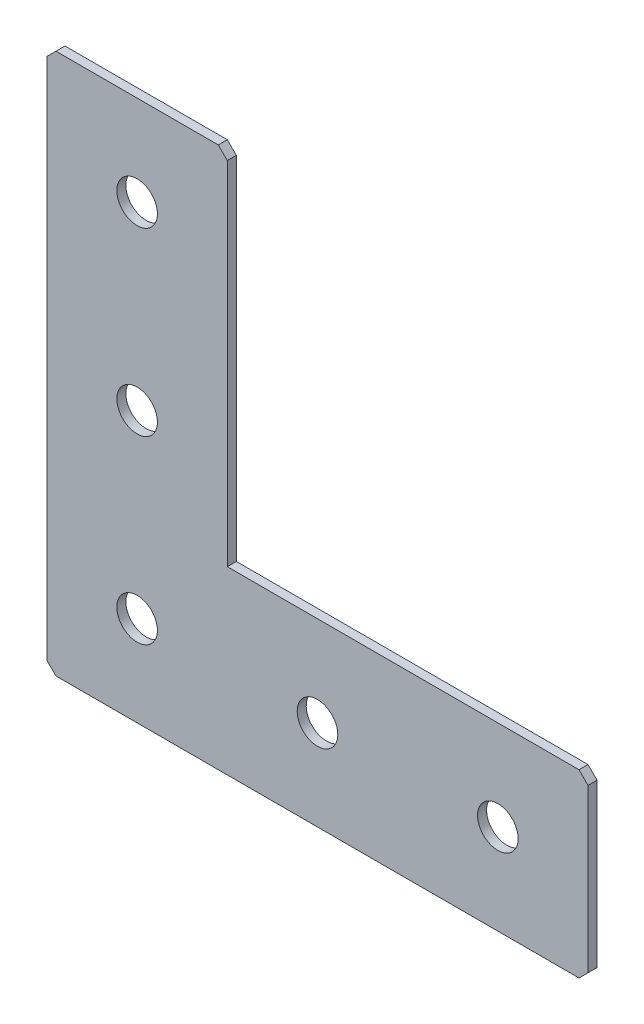
ISO-10303-21;
HEADER;
FILE_DESCRIPTION(('STEP AP214'),'2;1');
FILE_NAME('part.step','',(''),(''),'','','');
FILE_SCHEMA(('AUTOMOTIVE_DESIGN { 1 0 10303 214 1 1 1 1 }'));
ENDSEC;
DATA;
#1=APPLICATION_CONTEXT('core data for automotive mechanical design processes');
#2=APPLICATION_PROTOCOL_DEFINITION('international standard','automotive_design',2000,#1);
#3=PRODUCT_CONTEXT('',#1,'mechanical');
#4=PRODUCT('Part','Part','',(#3));
#5=PRODUCT_RELATED_PRODUCT_CATEGORY('part','',(#4));
#6=PRODUCT_DEFINITION_FORMATION('','',#4);
#7=PRODUCT_DEFINITION_CONTEXT('part definition',#1,'design');
#8=PRODUCT_DEFINITION('design','',#6,#7);
#9=PRODUCT_DEFINITION_SHAPE('','',#8);
#10=(LENGTH_UNIT() NAMED_UNIT(*) SI_UNIT(.MILLI.,.METRE.));
#11=(NAMED_UNIT(*) PLANE_ANGLE_UNIT() SI_UNIT($,.RADIAN.));
#12=(NAMED_UNIT(*) SI_UNIT($,.STERADIAN.) SOLID_ANGLE_UNIT());
#13=UNCERTAINTY_MEASURE_WITH_UNIT(LENGTH_MEASURE(1.E-05),#10,'distance_accuracy_value','');
#14=(GEOMETRIC_REPRESENTATION_CONTEXT(3) GLOBAL_UNCERTAINTY_ASSIGNED_CONTEXT((#13)) GLOBAL_UNIT_ASSIGNED_CONTEXT((#10,
#11,#12)) REPRESENTATION_CONTEXT('',''));
#15=CARTESIAN_POINT('',(0.,0.,0.));
#16=DIRECTION('',(0.,0.,1.));
#17=DIRECTION('',(1.,0.,0.));
#18=AXIS2_PLACEMENT_3D('',#15,#16,#17);
#19=CARTESIAN_POINT('',(0.,0.,0.));
#20=DIRECTION('',(0.,0.,1.));
#21=DIRECTION('',(1.,0.,0.));
#22=AXIS2_PLACEMENT_3D('',#19,#20,#21);
#23=PLANE('',#22);
#24=DIRECTION('',(1.,0.,0.));
#25=VECTOR('',#24,1.);
#26=CARTESIAN_POINT('',(40.,0.,0.));
#27=LINE('',#26,#25);
#28=CARTESIAN_POINT('',(2.,0.,0.));
#29=VERTEX_POINT('',#28);
#30=CARTESIAN_POINT('',(38.,0.,0.));
#31=VERTEX_POINT('',#30);
#32=EDGE_CURVE('E157',#29,#31,#27,.T.);
#33=ORIENTED_EDGE('',*,*,#32,.F.);
#34=DIRECTION('',(0.707106781186545,0.70710678118655,0.));
#35=VECTOR('',#34,1.);
#36=CARTESIAN_POINT('',(1.00000000000001,-1.,0.));
#37=LINE('',#36,#35);
#38=CARTESIAN_POINT('',(0.,-2.00000000000002,0.));
#39=VERTEX_POINT('',#38);
#40=EDGE_CURVE('E184',#29,#39,#37,.F.);
#41=ORIENTED_EDGE('',*,*,#40,.T.);
#42=DIRECTION('',(0.,1.,0.));
#43=VECTOR('',#42,1.);
#44=CARTESIAN_POINT('',(0.,0.,0.));
#45=LINE('',#44,#43);
#46=CARTESIAN_POINT('',(0.,-118.,0.));
#47=VERTEX_POINT('',#46);
#48=EDGE_CURVE('E169',#47,#39,#45,.T.);
#49=ORIENTED_EDGE('',*,*,#48,.F.);
#50=DIRECTION('',(-0.707106781186552,0.707106781186543,0.));
#51=VECTOR('',#50,1.);
#52=CARTESIAN_POINT('',(-59.,-59.0000000000008,0.));
#53=LINE('',#52,#51);
#54=CARTESIAN_POINT('',(2.00000000000003,-120.,0.));
#55=VERTEX_POINT('',#54);
#56=EDGE_CURVE('E176',#47,#55,#53,.F.);
#57=ORIENTED_EDGE('',*,*,#56,.T.);
#58=DIRECTION('',(-1.,0.,0.));
#59=VECTOR('',#58,1.);
#60=CARTESIAN_POINT('',(0.,-120.,0.));
#61=LINE('',#60,#59);
#62=CARTESIAN_POINT('',(118.,-120.,0.));
#63=VERTEX_POINT('',#62);
#64=EDGE_CURVE('E167',#63,#55,#61,.T.);
#65=ORIENTED_EDGE('',*,*,#64,.F.);
#66=DIRECTION('',(-0.707106781186543,-0.707106781186552,0.));
#67=VECTOR('',#66,1.);
#68=CARTESIAN_POINT('',(119.000000000001,-118.999999999999,0.));
#69=LINE('',#68,#67);
#70=CARTESIAN_POINT('',(120.,-118.,0.));
#71=VERTEX_POINT('',#70);
#72=EDGE_CURVE('E178',#63,#71,#69,.F.);
#73=ORIENTED_EDGE('',*,*,#72,.T.);
#74=DIRECTION('',(0.,-1.,0.));
#75=VECTOR('',#74,1.);
#76=CARTESIAN_POINT('',(120.,-120.,0.));
#77=LINE('',#76,#75);
#78=CARTESIAN_POINT('',(120.,-82.,0.));
#79=VERTEX_POINT('',#78);
#80=EDGE_CURVE('E164',#79,#71,#77,.T.);
#81=ORIENTED_EDGE('',*,*,#80,.F.);
#82=DIRECTION('',(0.707106781186548,-0.707106781186548,0.));
#83=VECTOR('',#82,1.);
#84=CARTESIAN_POINT('',(19.,19.,0.));
#85=LINE('',#84,#83);
#86=CARTESIAN_POINT('',(118.,-80.,0.));
#87=VERTEX_POINT('',#86);
#88=EDGE_CURVE('E180',#79,#87,#85,.F.);
#89=ORIENTED_EDGE('',*,*,#88,.T.);
#90=DIRECTION('',(1.,0.,0.));
#91=VECTOR('',#90,1.);
#92=CARTESIAN_POINT('',(120.,-80.,0.));
#93=LINE('',#92,#91);
#94=CARTESIAN_POINT('',(40.,-80.,0.));
#95=VERTEX_POINT('',#94);
#96=EDGE_CURVE('E162',#95,#87,#93,.T.);
#97=ORIENTED_EDGE('',*,*,#96,.F.);
#98=DIRECTION('',(0.,-1.,0.));
#99=VECTOR('',#98,1.);
#100=CARTESIAN_POINT('',(40.,-80.,0.));
#101=LINE('',#100,#99);
#102=CARTESIAN_POINT('',(40.,-2.,0.));
#103=VERTEX_POINT('',#102);
#104=EDGE_CURVE('E139',#103,#95,#101,.T.);
#105=ORIENTED_EDGE('',*,*,#104,.F.);
#106=DIRECTION('',(0.70710678118655,-0.707106781186545,0.));
#107=VECTOR('',#106,1.);
#108=CARTESIAN_POINT('',(18.9999999999998,19.,0.));
#109=LINE('',#108,#107);
#110=EDGE_CURVE('E182',#103,#31,#109,.F.);
#111=ORIENTED_EDGE('',*,*,#110,.T.);
#112=EDGE_LOOP('',(#33,#41,#49,#57,#65,#73,#81,#89,#97,#105,#111));
#113=FACE_BOUND('',#112,.T.);
#114=CARTESIAN_POINT('',(100.,-100.,0.));
#115=DIRECTION('',(0.,0.,-1.));
#116=DIRECTION('',(0.,1.,0.));
#117=AXIS2_PLACEMENT_3D('',#114,#115,#116);
#118=CIRCLE('',#117,4.5);
#119=CARTESIAN_POINT('',(100.,-95.5,0.));
#120=VERTEX_POINT('',#119);
#121=EDGE_CURVE('E160',#120,#120,#118,.T.);
#122=ORIENTED_EDGE('',*,*,#121,.T.);
#123=EDGE_LOOP('',(#122));
#124=FACE_BOUND('',#123,.T.);
#125=CARTESIAN_POINT('',(20.,-20.,0.));
#126=DIRECTION('',(0.,0.,-1.));
#127=DIRECTION('',(0.,1.,0.));
#128=AXIS2_PLACEMENT_3D('',#125,#126,#127);
#129=CIRCLE('',#128,4.5);
#130=CARTESIAN_POINT('',(20.,-15.5,0.));
#131=VERTEX_POINT('',#130);
#132=EDGE_CURVE('E243',#131,#131,#129,.T.);
#133=ORIENTED_EDGE('',*,*,#132,.T.);
#134=EDGE_LOOP('',(#133));
#135=FACE_BOUND('',#134,.T.);
#136=CARTESIAN_POINT('',(20.,-60.,0.));
#137=DIRECTION('',(0.,0.,-1.));
#138=DIRECTION('',(0.,1.,0.));
#139=AXIS2_PLACEMENT_3D('',#136,#137,#138);
#140=CIRCLE('',#139,4.5);
#141=CARTESIAN_POINT('',(20.,-55.5,0.));
#142=VERTEX_POINT('',#141);
#143=EDGE_CURVE('E249',#142,#142,#140,.T.);
#144=ORIENTED_EDGE('',*,*,#143,.T.);
#145=EDGE_LOOP('',(#144));
#146=FACE_BOUND('',#145,.T.);
#147=CARTESIAN_POINT('',(20.,-100.,0.));
#148=DIRECTION('',(0.,0.,-1.));
#149=DIRECTION('',(0.,1.,0.));
#150=AXIS2_PLACEMENT_3D('',#147,#148,#149);
#151=CIRCLE('',#150,4.5);
#152=CARTESIAN_POINT('',(20.,-95.5,0.));
#153=VERTEX_POINT('',#152);
#154=EDGE_CURVE('E255',#153,#153,#151,.T.);
#155=ORIENTED_EDGE('',*,*,#154,.T.);
#156=EDGE_LOOP('',(#155));
#157=FACE_BOUND('',#156,.T.);
#158=CARTESIAN_POINT('',(60.,-100.,0.));
#159=DIRECTION('',(0.,0.,-1.));
#160=DIRECTION('',(0.,1.,0.));
#161=AXIS2_PLACEMENT_3D('',#158,#159,#160);
#162=CIRCLE('',#161,4.5);
#163=CARTESIAN_POINT('',(60.,-95.5,0.));
#164=VERTEX_POINT('',#163);
#165=EDGE_CURVE('E261',#164,#164,#162,.T.);
#166=ORIENTED_EDGE('',*,*,#165,.T.);
#167=EDGE_LOOP('',(#166));
#168=FACE_BOUND('',#167,.T.);
#169=ADVANCED_FACE('F37',(#113,#124,#135,#146,#157,#168),#23,.T.);
#170=CARTESIAN_POINT('',(40.,0.,-2.));
#171=DIRECTION('',(0.,-1.,0.));
#172=DIRECTION('',(1.,0.,0.));
#173=AXIS2_PLACEMENT_3D('',#170,#171,#172);
#174=PLANE('',#173);
#175=DIRECTION('',(1.,0.,0.));
#176=VECTOR('',#175,1.);
#177=CARTESIAN_POINT('',(40.,0.,-2.));
#178=LINE('',#177,#176);
#179=CARTESIAN_POINT('',(2.,0.,-2.));
#180=VERTEX_POINT('',#179);
#181=CARTESIAN_POINT('',(38.,0.,-2.));
#182=VERTEX_POINT('',#181);
#183=EDGE_CURVE('E133',#180,#182,#178,.T.);
#184=ORIENTED_EDGE('',*,*,#183,.F.);
#185=DIRECTION('',(0.,0.,1.));
#186=VECTOR('',#185,1.);
#187=CARTESIAN_POINT('',(2.,0.,-2.));
#188=LINE('',#187,#186);
#189=EDGE_CURVE('E173',#180,#29,#188,.T.);
#190=ORIENTED_EDGE('',*,*,#189,.T.);
#191=ORIENTED_EDGE('',*,*,#32,.T.);
#192=DIRECTION('',(0.,0.,-1.));
#193=VECTOR('',#192,1.);
#194=CARTESIAN_POINT('',(38.,0.,-2.));
#195=LINE('',#194,#193);
#196=EDGE_CURVE('E143',#31,#182,#195,.T.);
#197=ORIENTED_EDGE('',*,*,#196,.T.);
#198=EDGE_LOOP('',(#184,#190,#191,#197));
#199=FACE_BOUND('',#198,.T.);
#200=ADVANCED_FACE('F235',(#199),#174,.F.);
#201=CARTESIAN_POINT('',(40.,-80.,-2.));
#202=DIRECTION('',(-1.,0.,0.));
#203=DIRECTION('',(0.,-1.,0.));
#204=AXIS2_PLACEMENT_3D('',#201,#202,#203);
#205=PLANE('',#204);
#206=DIRECTION('',(0.,-1.,0.));
#207=VECTOR('',#206,1.);
#208=CARTESIAN_POINT('',(40.,-80.,-2.));
#209=LINE('',#208,#207);
#210=CARTESIAN_POINT('',(40.,-2.,-2.));
#211=VERTEX_POINT('',#210);
#212=CARTESIAN_POINT('',(40.,-80.,-2.));
#213=VERTEX_POINT('',#212);
#214=EDGE_CURVE('E120',#211,#213,#209,.T.);
#215=ORIENTED_EDGE('',*,*,#214,.F.);
#216=DIRECTION('',(0.,0.,1.));
#217=VECTOR('',#216,1.);
#218=CARTESIAN_POINT('',(40.,-2.,-2.));
#219=LINE('',#218,#217);
#220=EDGE_CURVE('E199',#211,#103,#219,.T.);
#221=ORIENTED_EDGE('',*,*,#220,.T.);
#222=ORIENTED_EDGE('',*,*,#104,.T.);
#223=DIRECTION('',(0.,0.,1.));
#224=VECTOR('',#223,1.);
#225=CARTESIAN_POINT('',(40.,-80.,-2.));
#226=LINE('',#225,#224);
#227=EDGE_CURVE('E136',#213,#95,#226,.T.);
#228=ORIENTED_EDGE('',*,*,#227,.F.);
#229=EDGE_LOOP('',(#215,#221,#222,#228));
#230=FACE_BOUND('',#229,.T.);
#231=ADVANCED_FACE('F137',(#230),#205,.F.);
#232=CARTESIAN_POINT('',(120.,-80.,-2.));
#233=DIRECTION('',(0.,-1.,0.));
#234=DIRECTION('',(1.,0.,0.));
#235=AXIS2_PLACEMENT_3D('',#232,#233,#234);
#236=PLANE('',#235);
#237=ORIENTED_EDGE('',*,*,#96,.T.);
#238=DIRECTION('',(0.,0.,-1.));
#239=VECTOR('',#238,1.);
#240=CARTESIAN_POINT('',(118.,-80.,-2.));
#241=LINE('',#240,#239);
#242=CARTESIAN_POINT('',(118.,-80.,-2.));
#243=VERTEX_POINT('',#242);
#244=EDGE_CURVE('E148',#87,#243,#241,.T.);
#245=ORIENTED_EDGE('',*,*,#244,.T.);
#246=DIRECTION('',(1.,0.,0.));
#247=VECTOR('',#246,1.);
#248=CARTESIAN_POINT('',(120.,-80.,-2.));
#249=LINE('',#248,#247);
#250=EDGE_CURVE('E125',#213,#243,#249,.T.);
#251=ORIENTED_EDGE('',*,*,#250,.F.);
#252=ORIENTED_EDGE('',*,*,#227,.T.);
#253=EDGE_LOOP('',(#237,#245,#251,#252));
#254=FACE_BOUND('',#253,.T.);
#255=ADVANCED_FACE('F146',(#254),#236,.F.);
#256=CARTESIAN_POINT('',(120.,-120.,-2.));
#257=DIRECTION('',(-1.,0.,0.));
#258=DIRECTION('',(0.,0.,1.));
#259=AXIS2_PLACEMENT_3D('',#256,#257,#258);
#260=PLANE('',#259);
#261=DIRECTION('',(0.,-1.,0.));
#262=VECTOR('',#261,1.);
#263=CARTESIAN_POINT('',(120.,-120.,-2.));
#264=LINE('',#263,#262);
#265=CARTESIAN_POINT('',(120.,-82.,-2.));
#266=VERTEX_POINT('',#265);
#267=CARTESIAN_POINT('',(120.,-118.,-2.));
#268=VERTEX_POINT('',#267);
#269=EDGE_CURVE('E149',#266,#268,#264,.T.);
#270=ORIENTED_EDGE('',*,*,#269,.F.);
#271=DIRECTION('',(0.,0.,1.));
#272=VECTOR('',#271,1.);
#273=CARTESIAN_POINT('',(120.,-82.,-2.));
#274=LINE('',#273,#272);
#275=EDGE_CURVE('E203',#266,#79,#274,.T.);
#276=ORIENTED_EDGE('',*,*,#275,.T.);
#277=ORIENTED_EDGE('',*,*,#80,.T.);
#278=DIRECTION('',(0.,0.,-1.));
#279=VECTOR('',#278,1.);
#280=CARTESIAN_POINT('',(120.,-118.,-2.));
#281=LINE('',#280,#279);
#282=EDGE_CURVE('E201',#71,#268,#281,.T.);
#283=ORIENTED_EDGE('',*,*,#282,.T.);
#284=EDGE_LOOP('',(#270,#276,#277,#283));
#285=FACE_BOUND('',#284,.T.);
#286=ADVANCED_FACE('F210',(#285),#260,.F.);
#287=CARTESIAN_POINT('',(0.,-120.,-2.));
#288=DIRECTION('',(0.,1.,0.));
#289=DIRECTION('',(0.,0.,1.));
#290=AXIS2_PLACEMENT_3D('',#287,#288,#289);
#291=PLANE('',#290);
#292=DIRECTION('',(-1.,0.,0.));
#293=VECTOR('',#292,1.);
#294=CARTESIAN_POINT('',(0.,-120.,-2.));
#295=LINE('',#294,#293);
#296=CARTESIAN_POINT('',(118.,-120.,-2.));
#297=VERTEX_POINT('',#296);
#298=CARTESIAN_POINT('',(2.00000000000003,-120.,-2.));
#299=VERTEX_POINT('',#298);
#300=EDGE_CURVE('E151',#297,#299,#295,.T.);
#301=ORIENTED_EDGE('',*,*,#300,.F.);
#302=DIRECTION('',(0.,0.,1.));
#303=VECTOR('',#302,1.);
#304=CARTESIAN_POINT('',(118.,-120.,-2.));
#305=LINE('',#304,#303);
#306=EDGE_CURVE('E11',#297,#63,#305,.T.);
#307=ORIENTED_EDGE('',*,*,#306,.T.);
#308=ORIENTED_EDGE('',*,*,#64,.T.);
#309=DIRECTION('',(0.,0.,-1.));
#310=VECTOR('',#309,1.);
#311=CARTESIAN_POINT('',(2.00000000000003,-120.,-2.));
#312=LINE('',#311,#310);
#313=EDGE_CURVE('E45',#55,#299,#312,.T.);
#314=ORIENTED_EDGE('',*,*,#313,.T.);
#315=EDGE_LOOP('',(#301,#307,#308,#314));
#316=FACE_BOUND('',#315,.T.);
#317=ADVANCED_FACE('F220',(#316),#291,.F.);
#318=CARTESIAN_POINT('',(0.,0.,-2.));
#319=DIRECTION('',(1.,0.,0.));
#320=DIRECTION('',(0.,0.,-1.));
#321=AXIS2_PLACEMENT_3D('',#318,#319,#320);
#322=PLANE('',#321);
#323=ORIENTED_EDGE('',*,*,#48,.T.);
#324=DIRECTION('',(0.,0.,-1.));
#325=VECTOR('',#324,1.);
#326=CARTESIAN_POINT('',(0.,-2.00000000000002,-2.));
#327=LINE('',#326,#325);
#328=CARTESIAN_POINT('',(0.,-2.00000000000002,-2.));
#329=VERTEX_POINT('',#328);
#330=EDGE_CURVE('E189',#39,#329,#327,.T.);
#331=ORIENTED_EDGE('',*,*,#330,.T.);
#332=DIRECTION('',(0.,1.,0.));
#333=VECTOR('',#332,1.);
#334=CARTESIAN_POINT('',(0.,0.,-2.));
#335=LINE('',#334,#333);
#336=CARTESIAN_POINT('',(0.,-118.,-2.));
#337=VERTEX_POINT('',#336);
#338=EDGE_CURVE('E144',#337,#329,#335,.T.);
#339=ORIENTED_EDGE('',*,*,#338,.F.);
#340=DIRECTION('',(0.,0.,1.));
#341=VECTOR('',#340,1.);
#342=CARTESIAN_POINT('',(0.,-118.,-2.));
#343=LINE('',#342,#341);
#344=EDGE_CURVE('E186',#337,#47,#343,.T.);
#345=ORIENTED_EDGE('',*,*,#344,.T.);
#346=EDGE_LOOP('',(#323,#331,#339,#345));
#347=FACE_BOUND('',#346,.T.);
#348=ADVANCED_FACE('F227',(#347),#322,.F.);
#349=CARTESIAN_POINT('',(0.,0.,-2.));
#350=DIRECTION('',(0.,0.,1.));
#351=DIRECTION('',(1.,0.,0.));
#352=AXIS2_PLACEMENT_3D('',#349,#350,#351);
#353=PLANE('',#352);
#354=CARTESIAN_POINT('',(60.,-100.,-2.00000000000001));
#355=DIRECTION('',(0.,0.,-1.));
#356=DIRECTION('',(0.,1.,0.));
#357=AXIS2_PLACEMENT_3D('',#354,#355,#356);
#358=CIRCLE('',#357,4.5);
#359=CARTESIAN_POINT('',(60.,-95.5,-2.00000000000001));
#360=VERTEX_POINT('',#359);
#361=EDGE_CURVE('E264',#360,#360,#358,.T.);
#362=ORIENTED_EDGE('',*,*,#361,.F.);
#363=EDGE_LOOP('',(#362));
#364=FACE_BOUND('',#363,.T.);
#365=CARTESIAN_POINT('',(20.,-100.,-2.00000000000001));
#366=DIRECTION('',(0.,0.,-1.));
#367=DIRECTION('',(0.,1.,0.));
#368=AXIS2_PLACEMENT_3D('',#365,#366,#367);
#369=CIRCLE('',#368,4.5);
#370=CARTESIAN_POINT('',(20.,-95.5,-2.00000000000001));
#371=VERTEX_POINT('',#370);
#372=EDGE_CURVE('E258',#371,#371,#369,.T.);
#373=ORIENTED_EDGE('',*,*,#372,.F.);
#374=EDGE_LOOP('',(#373));
#375=FACE_BOUND('',#374,.T.);
#376=CARTESIAN_POINT('',(20.,-60.,-2.));
#377=DIRECTION('',(0.,0.,-1.));
#378=DIRECTION('',(0.,1.,0.));
#379=AXIS2_PLACEMENT_3D('',#376,#377,#378);
#380=CIRCLE('',#379,4.5);
#381=CARTESIAN_POINT('',(20.,-55.5,-2.));
#382=VERTEX_POINT('',#381);
#383=EDGE_CURVE('E252',#382,#382,#380,.T.);
#384=ORIENTED_EDGE('',*,*,#383,.F.);
#385=EDGE_LOOP('',(#384));
#386=FACE_BOUND('',#385,.T.);
#387=CARTESIAN_POINT('',(20.,-20.,-2.));
#388=DIRECTION('',(0.,0.,-1.));
#389=DIRECTION('',(0.,1.,0.));
#390=AXIS2_PLACEMENT_3D('',#387,#388,#389);
#391=CIRCLE('',#390,4.5);
#392=CARTESIAN_POINT('',(20.,-15.5,-2.));
#393=VERTEX_POINT('',#392);
#394=EDGE_CURVE('E246',#393,#393,#391,.T.);
#395=ORIENTED_EDGE('',*,*,#394,.F.);
#396=EDGE_LOOP('',(#395));
#397=FACE_BOUND('',#396,.T.);
#398=CARTESIAN_POINT('',(100.,-100.,-2.00000000000001));
#399=DIRECTION('',(0.,0.,-1.));
#400=DIRECTION('',(0.,1.,0.));
#401=AXIS2_PLACEMENT_3D('',#398,#399,#400);
#402=CIRCLE('',#401,4.5);
#403=CARTESIAN_POINT('',(100.,-95.5,-2.00000000000001));
#404=VERTEX_POINT('',#403);
#405=EDGE_CURVE('E240',#404,#404,#402,.T.);
#406=ORIENTED_EDGE('',*,*,#405,.F.);
#407=EDGE_LOOP('',(#406));
#408=FACE_BOUND('',#407,.T.);
#409=ORIENTED_EDGE('',*,*,#338,.T.);
#410=DIRECTION('',(-0.707106781186545,-0.70710678118655,0.));
#411=VECTOR('',#410,1.);
#412=CARTESIAN_POINT('',(2.,0.,-2.));
#413=LINE('',#412,#411);
#414=EDGE_CURVE('E197',#329,#180,#413,.F.);
#415=ORIENTED_EDGE('',*,*,#414,.T.);
#416=ORIENTED_EDGE('',*,*,#183,.T.);
#417=DIRECTION('',(-0.70710678118655,0.707106781186545,0.));
#418=VECTOR('',#417,1.);
#419=CARTESIAN_POINT('',(40.,-2.,-2.));
#420=LINE('',#419,#418);
#421=EDGE_CURVE('E129',#182,#211,#420,.F.);
#422=ORIENTED_EDGE('',*,*,#421,.T.);
#423=ORIENTED_EDGE('',*,*,#214,.T.);
#424=ORIENTED_EDGE('',*,*,#250,.T.);
#425=DIRECTION('',(-0.707106781186548,0.707106781186548,0.));
#426=VECTOR('',#425,1.);
#427=CARTESIAN_POINT('',(120.,-82.,-2.));
#428=LINE('',#427,#426);
#429=EDGE_CURVE('E194',#243,#266,#428,.F.);
#430=ORIENTED_EDGE('',*,*,#429,.T.);
#431=ORIENTED_EDGE('',*,*,#269,.T.);
#432=DIRECTION('',(0.707106781186543,0.707106781186552,0.));
#433=VECTOR('',#432,1.);
#434=CARTESIAN_POINT('',(118.,-120.,-2.));
#435=LINE('',#434,#433);
#436=EDGE_CURVE('E58',#268,#297,#435,.F.);
#437=ORIENTED_EDGE('',*,*,#436,.T.);
#438=ORIENTED_EDGE('',*,*,#300,.T.);
#439=DIRECTION('',(0.707106781186552,-0.707106781186543,0.));
#440=VECTOR('',#439,1.);
#441=CARTESIAN_POINT('',(0.,-118.,-2.));
#442=LINE('',#441,#440);
#443=EDGE_CURVE('E191',#299,#337,#442,.F.);
#444=ORIENTED_EDGE('',*,*,#443,.T.);
#445=EDGE_LOOP('',(#409,#415,#416,#422,#423,#424,#430,#431,#437,#438,#444));
#446=FACE_BOUND('',#445,.T.);
#447=ADVANCED_FACE('F123',(#364,#375,#386,#397,#408,#446),#353,.F.);
#448=CARTESIAN_POINT('',(100.,-100.,-2.00000000000001));
#449=DIRECTION('',(0.,0.,-1.));
#450=DIRECTION('',(0.,1.,0.));
#451=AXIS2_PLACEMENT_3D('',#448,#449,#450);
#452=CYLINDRICAL_SURFACE('',#451,4.5);
#453=ORIENTED_EDGE('',*,*,#121,.F.);
#454=EDGE_LOOP('',(#453));
#455=FACE_BOUND('',#454,.T.);
#456=ORIENTED_EDGE('',*,*,#405,.T.);
#457=EDGE_LOOP('',(#456));
#458=FACE_BOUND('',#457,.T.);
#459=ADVANCED_FACE('F272',(#455,#458),#452,.F.);
#460=CARTESIAN_POINT('',(20.,-20.,-2.));
#461=DIRECTION('',(0.,0.,-1.));
#462=DIRECTION('',(0.,1.,0.));
#463=AXIS2_PLACEMENT_3D('',#460,#461,#462);
#464=CYLINDRICAL_SURFACE('',#463,4.5);
#465=ORIENTED_EDGE('',*,*,#132,.F.);
#466=EDGE_LOOP('',(#465));
#467=FACE_BOUND('',#466,.T.);
#468=ORIENTED_EDGE('',*,*,#394,.T.);
#469=EDGE_LOOP('',(#468));
#470=FACE_BOUND('',#469,.T.);
#471=ADVANCED_FACE('F283',(#467,#470),#464,.F.);
#472=CARTESIAN_POINT('',(20.,-60.,-2.));
#473=DIRECTION('',(0.,0.,-1.));
#474=DIRECTION('',(0.,1.,0.));
#475=AXIS2_PLACEMENT_3D('',#472,#473,#474);
#476=CYLINDRICAL_SURFACE('',#475,4.5);
#477=ORIENTED_EDGE('',*,*,#143,.F.);
#478=EDGE_LOOP('',(#477));
#479=FACE_BOUND('',#478,.T.);
#480=ORIENTED_EDGE('',*,*,#383,.T.);
#481=EDGE_LOOP('',(#480));
#482=FACE_BOUND('',#481,.T.);
#483=ADVANCED_FACE('F289',(#479,#482),#476,.F.);
#484=CARTESIAN_POINT('',(20.,-100.,-2.00000000000001));
#485=DIRECTION('',(0.,0.,-1.));
#486=DIRECTION('',(0.,1.,0.));
#487=AXIS2_PLACEMENT_3D('',#484,#485,#486);
#488=CYLINDRICAL_SURFACE('',#487,4.5);
#489=ORIENTED_EDGE('',*,*,#154,.F.);
#490=EDGE_LOOP('',(#489));
#491=FACE_BOUND('',#490,.T.);
#492=ORIENTED_EDGE('',*,*,#372,.T.);
#493=EDGE_LOOP('',(#492));
#494=FACE_BOUND('',#493,.T.);
#495=ADVANCED_FACE('F402',(#491,#494),#488,.F.);
#496=CARTESIAN_POINT('',(60.,-100.,-2.00000000000001));
#497=DIRECTION('',(0.,0.,-1.));
#498=DIRECTION('',(0.,1.,0.));
#499=AXIS2_PLACEMENT_3D('',#496,#497,#498);
#500=CYLINDRICAL_SURFACE('',#499,4.5);
#501=ORIENTED_EDGE('',*,*,#165,.F.);
#502=EDGE_LOOP('',(#501));
#503=FACE_BOUND('',#502,.T.);
#504=ORIENTED_EDGE('',*,*,#361,.T.);
#505=EDGE_LOOP('',(#504));
#506=FACE_BOUND('',#505,.T.);
#507=ADVANCED_FACE('F268',(#503,#506),#500,.F.);
#508=CARTESIAN_POINT('',(2.,0.,-2.));
#509=DIRECTION('',(0.70710678118655,-0.707106781186545,0.));
#510=DIRECTION('',(0.,0.,1.));
#511=AXIS2_PLACEMENT_3D('',#508,#509,#510);
#512=PLANE('',#511);
#513=ORIENTED_EDGE('',*,*,#414,.F.);
#514=ORIENTED_EDGE('',*,*,#330,.F.);
#515=ORIENTED_EDGE('',*,*,#40,.F.);
#516=ORIENTED_EDGE('',*,*,#189,.F.);
#517=EDGE_LOOP('',(#513,#514,#515,#516));
#518=FACE_BOUND('',#517,.T.);
#519=ADVANCED_FACE('F232',(#518),#512,.F.);
#520=CARTESIAN_POINT('',(40.,-2.,-2.));
#521=DIRECTION('',(-0.707106781186545,-0.70710678118655,0.));
#522=DIRECTION('',(0.,0.,1.));
#523=AXIS2_PLACEMENT_3D('',#520,#521,#522);
#524=PLANE('',#523);
#525=ORIENTED_EDGE('',*,*,#421,.F.);
#526=ORIENTED_EDGE('',*,*,#196,.F.);
#527=ORIENTED_EDGE('',*,*,#110,.F.);
#528=ORIENTED_EDGE('',*,*,#220,.F.);
#529=EDGE_LOOP('',(#525,#526,#527,#528));
#530=FACE_BOUND('',#529,.T.);
#531=ADVANCED_FACE('F312',(#530),#524,.F.);
#532=CARTESIAN_POINT('',(120.,-82.,-2.));
#533=DIRECTION('',(-0.707106781186547,-0.707106781186547,0.));
#534=DIRECTION('',(0.,0.,1.));
#535=AXIS2_PLACEMENT_3D('',#532,#533,#534);
#536=PLANE('',#535);
#537=ORIENTED_EDGE('',*,*,#429,.F.);
#538=ORIENTED_EDGE('',*,*,#244,.F.);
#539=ORIENTED_EDGE('',*,*,#88,.F.);
#540=ORIENTED_EDGE('',*,*,#275,.F.);
#541=EDGE_LOOP('',(#537,#538,#539,#540));
#542=FACE_BOUND('',#541,.T.);
#543=ADVANCED_FACE('F315',(#542),#536,.F.);
#544=CARTESIAN_POINT('',(118.,-120.,-2.));
#545=DIRECTION('',(-0.707106781186552,0.707106781186542,0.));
#546=DIRECTION('',(0.,0.,1.));
#547=AXIS2_PLACEMENT_3D('',#544,#545,#546);
#548=PLANE('',#547);
#549=ORIENTED_EDGE('',*,*,#436,.F.);
#550=ORIENTED_EDGE('',*,*,#282,.F.);
#551=ORIENTED_EDGE('',*,*,#72,.F.);
#552=ORIENTED_EDGE('',*,*,#306,.F.);
#553=EDGE_LOOP('',(#549,#550,#551,#552));
#554=FACE_BOUND('',#553,.T.);
#555=ADVANCED_FACE('F219',(#554),#548,.F.);
#556=CARTESIAN_POINT('',(0.,-118.,-2.));
#557=DIRECTION('',(0.707106781186542,0.707106781186552,0.));
#558=DIRECTION('',(0.,0.,1.));
#559=AXIS2_PLACEMENT_3D('',#556,#557,#558);
#560=PLANE('',#559);
#561=ORIENTED_EDGE('',*,*,#443,.F.);
#562=ORIENTED_EDGE('',*,*,#313,.F.);
#563=ORIENTED_EDGE('',*,*,#56,.F.);
#564=ORIENTED_EDGE('',*,*,#344,.F.);
#565=EDGE_LOOP('',(#561,#562,#563,#564));
#566=FACE_BOUND('',#565,.T.);
#567=ADVANCED_FACE('F39',(#566),#560,.F.);
#568=CLOSED_SHELL('',(#169,#200,#231,#255,#286,#317,#348,#447,#459,#471,#483,#495,#507,#519,
#531,#543,#555,#567));
#569=MANIFOLD_SOLID_BREP('B2',#568);
#570=ADVANCED_BREP_SHAPE_REPRESENTATION('',(#18,#569),#14);
#571=SHAPE_DEFINITION_REPRESENTATION(#9,#570);
ENDSEC;
END-ISO-10303-21;
